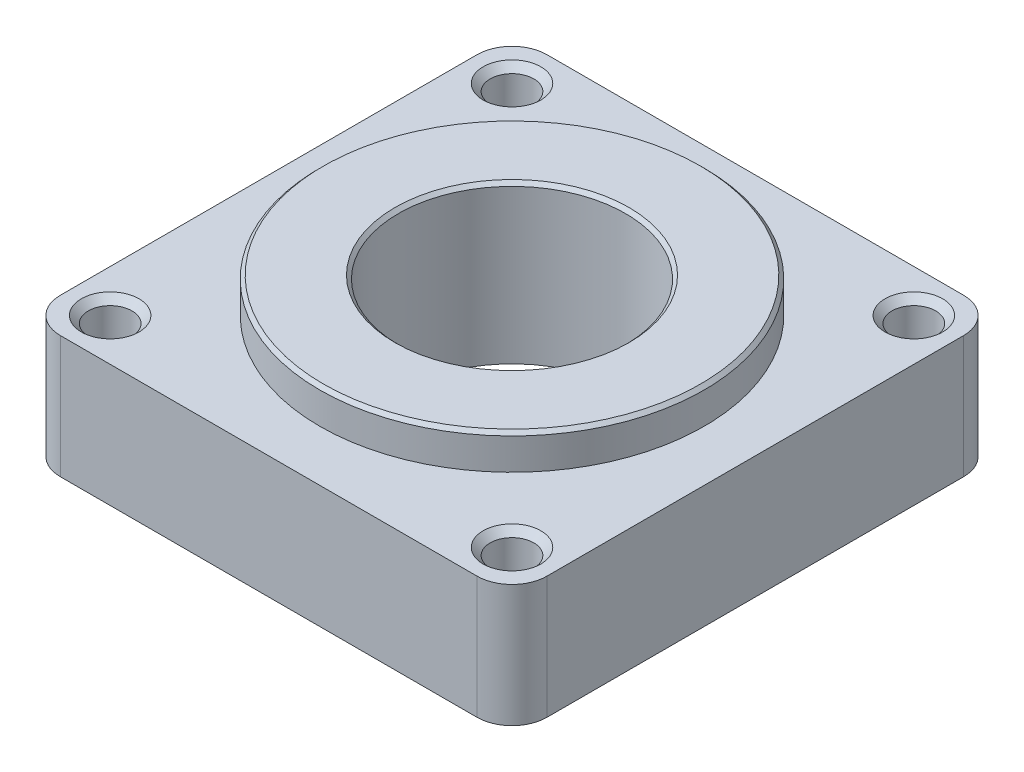
ISO-10303-21;
HEADER;
FILE_DESCRIPTION(('STEP AP214'),'2;1');
FILE_NAME('part.step','',(''),(''),'','','');
FILE_SCHEMA(('AUTOMOTIVE_DESIGN { 1 0 10303 214 1 1 1 1 }'));
ENDSEC;
DATA;
#1=APPLICATION_CONTEXT('core data for automotive mechanical design processes');
#2=APPLICATION_PROTOCOL_DEFINITION('international standard','automotive_design',2000,#1);
#3=PRODUCT_CONTEXT('',#1,'mechanical');
#4=PRODUCT('Part','Part','',(#3));
#5=PRODUCT_RELATED_PRODUCT_CATEGORY('part','',(#4));
#6=PRODUCT_DEFINITION_FORMATION('','',#4);
#7=PRODUCT_DEFINITION_CONTEXT('part definition',#1,'design');
#8=PRODUCT_DEFINITION('design','',#6,#7);
#9=PRODUCT_DEFINITION_SHAPE('','',#8);
#10=(LENGTH_UNIT() NAMED_UNIT(*) SI_UNIT(.MILLI.,.METRE.));
#11=(NAMED_UNIT(*) PLANE_ANGLE_UNIT() SI_UNIT($,.RADIAN.));
#12=(NAMED_UNIT(*) SI_UNIT($,.STERADIAN.) SOLID_ANGLE_UNIT());
#13=UNCERTAINTY_MEASURE_WITH_UNIT(LENGTH_MEASURE(1.E-05),#10,'distance_accuracy_value','');
#14=(GEOMETRIC_REPRESENTATION_CONTEXT(3) GLOBAL_UNCERTAINTY_ASSIGNED_CONTEXT((#13)) GLOBAL_UNIT_ASSIGNED_CONTEXT((#10,
#11,#12)) REPRESENTATION_CONTEXT('',''));
#15=CARTESIAN_POINT('',(0.,0.,0.));
#16=DIRECTION('',(0.,0.,1.));
#17=DIRECTION('',(1.,0.,0.));
#18=AXIS2_PLACEMENT_3D('',#15,#16,#17);
#19=CARTESIAN_POINT('',(0.,7.,0.));
#20=DIRECTION('',(0.,1.,0.));
#21=DIRECTION('',(0.,0.,1.));
#22=AXIS2_PLACEMENT_3D('',#19,#20,#21);
#23=PLANE('',#22);
#24=CARTESIAN_POINT('',(11.5,7.,-11.5));
#25=DIRECTION('',(0.,1.,0.));
#26=DIRECTION('',(0.,0.,1.));
#27=AXIS2_PLACEMENT_3D('',#24,#25,#26);
#28=CIRCLE('',#27,1.65);
#29=CARTESIAN_POINT('',(11.5,7.,-9.85));
#30=VERTEX_POINT('',#29);
#31=EDGE_CURVE('E205',#30,#30,#28,.F.);
#32=ORIENTED_EDGE('',*,*,#31,.T.);
#33=EDGE_LOOP('',(#32));
#34=FACE_BOUND('',#33,.T.);
#35=CARTESIAN_POINT('',(-11.5,7.,-11.5));
#36=DIRECTION('',(0.,1.,0.));
#37=DIRECTION('',(0.,0.,1.));
#38=AXIS2_PLACEMENT_3D('',#35,#36,#37);
#39=CIRCLE('',#38,1.65);
#40=CARTESIAN_POINT('',(-11.5,7.,-9.85));
#41=VERTEX_POINT('',#40);
#42=EDGE_CURVE('E202',#41,#41,#39,.F.);
#43=ORIENTED_EDGE('',*,*,#42,.T.);
#44=EDGE_LOOP('',(#43));
#45=FACE_BOUND('',#44,.T.);
#46=CARTESIAN_POINT('',(11.5,7.,11.5));
#47=DIRECTION('',(0.,1.,0.));
#48=DIRECTION('',(0.,0.,1.));
#49=AXIS2_PLACEMENT_3D('',#46,#47,#48);
#50=CIRCLE('',#49,1.65);
#51=CARTESIAN_POINT('',(11.5,7.,13.15));
#52=VERTEX_POINT('',#51);
#53=EDGE_CURVE('E199',#52,#52,#50,.F.);
#54=ORIENTED_EDGE('',*,*,#53,.T.);
#55=EDGE_LOOP('',(#54));
#56=FACE_BOUND('',#55,.T.);
#57=CARTESIAN_POINT('',(-11.5,7.,11.5));
#58=DIRECTION('',(0.,1.,0.));
#59=DIRECTION('',(0.,0.,1.));
#60=AXIS2_PLACEMENT_3D('',#57,#58,#59);
#61=CIRCLE('',#60,1.65);
#62=CARTESIAN_POINT('',(-11.5,7.,13.15));
#63=VERTEX_POINT('',#62);
#64=EDGE_CURVE('E196',#63,#63,#61,.F.);
#65=ORIENTED_EDGE('',*,*,#64,.T.);
#66=EDGE_LOOP('',(#65));
#67=FACE_BOUND('',#66,.T.);
#68=DIRECTION('',(0.,0.,1.));
#69=VECTOR('',#68,1.);
#70=CARTESIAN_POINT('',(-13.925,7.,0.));
#71=LINE('',#70,#69);
#72=CARTESIAN_POINT('',(-13.925,7.,-11.925));
#73=VERTEX_POINT('',#72);
#74=CARTESIAN_POINT('',(-13.925,7.,11.925));
#75=VERTEX_POINT('',#74);
#76=EDGE_CURVE('E164',#73,#75,#71,.T.);
#77=ORIENTED_EDGE('',*,*,#76,.T.);
#78=CARTESIAN_POINT('',(-11.925,7.,11.925));
#79=DIRECTION('',(0.,1.,0.));
#80=DIRECTION('',(0.,0.,1.));
#81=AXIS2_PLACEMENT_3D('',#78,#79,#80);
#82=CIRCLE('',#81,2.);
#83=CARTESIAN_POINT('',(-11.925,7.,13.925));
#84=VERTEX_POINT('',#83);
#85=EDGE_CURVE('E151',#75,#84,#82,.T.);
#86=ORIENTED_EDGE('',*,*,#85,.T.);
#87=DIRECTION('',(-1.,0.,0.));
#88=VECTOR('',#87,1.);
#89=CARTESIAN_POINT('',(0.,7.,13.925));
#90=LINE('',#89,#88);
#91=CARTESIAN_POINT('',(11.925,7.,13.925));
#92=VERTEX_POINT('',#91);
#93=EDGE_CURVE('E162',#92,#84,#90,.T.);
#94=ORIENTED_EDGE('',*,*,#93,.F.);
#95=CARTESIAN_POINT('',(11.925,7.,11.925));
#96=DIRECTION('',(0.,1.,0.));
#97=DIRECTION('',(0.,0.,1.));
#98=AXIS2_PLACEMENT_3D('',#95,#96,#97);
#99=CIRCLE('',#98,2.);
#100=CARTESIAN_POINT('',(13.925,7.,11.925));
#101=VERTEX_POINT('',#100);
#102=EDGE_CURVE('E128',#92,#101,#99,.T.);
#103=ORIENTED_EDGE('',*,*,#102,.T.);
#104=DIRECTION('',(0.,0.,1.));
#105=VECTOR('',#104,1.);
#106=CARTESIAN_POINT('',(13.925,7.,0.));
#107=LINE('',#106,#105);
#108=CARTESIAN_POINT('',(13.925,7.,-11.925));
#109=VERTEX_POINT('',#108);
#110=EDGE_CURVE('E160',#109,#101,#107,.T.);
#111=ORIENTED_EDGE('',*,*,#110,.F.);
#112=CARTESIAN_POINT('',(11.925,7.,-11.925));
#113=DIRECTION('',(0.,1.,0.));
#114=DIRECTION('',(0.,0.,1.));
#115=AXIS2_PLACEMENT_3D('',#112,#113,#114);
#116=CIRCLE('',#115,2.);
#117=CARTESIAN_POINT('',(11.925,7.,-13.925));
#118=VERTEX_POINT('',#117);
#119=EDGE_CURVE('E53',#109,#118,#116,.T.);
#120=ORIENTED_EDGE('',*,*,#119,.T.);
#121=DIRECTION('',(1.,0.,0.));
#122=VECTOR('',#121,1.);
#123=CARTESIAN_POINT('',(0.,7.,-13.925));
#124=LINE('',#123,#122);
#125=CARTESIAN_POINT('',(-11.925,7.,-13.925));
#126=VERTEX_POINT('',#125);
#127=EDGE_CURVE('E161',#126,#118,#124,.T.);
#128=ORIENTED_EDGE('',*,*,#127,.F.);
#129=CARTESIAN_POINT('',(-11.925,7.,-11.925));
#130=DIRECTION('',(0.,1.,0.));
#131=DIRECTION('',(0.,0.,1.));
#132=AXIS2_PLACEMENT_3D('',#129,#130,#131);
#133=CIRCLE('',#132,2.);
#134=EDGE_CURVE('E149',#126,#73,#133,.T.);
#135=ORIENTED_EDGE('',*,*,#134,.T.);
#136=EDGE_LOOP('',(#77,#86,#94,#103,#111,#120,#128,#135));
#137=FACE_BOUND('',#136,.T.);
#138=CARTESIAN_POINT('',(0.,7.,0.));
#139=DIRECTION('',(0.,1.,0.));
#140=DIRECTION('',(0.,0.,1.));
#141=AXIS2_PLACEMENT_3D('',#138,#139,#140);
#142=CIRCLE('',#141,11.);
#143=CARTESIAN_POINT('',(0.,7.,11.));
#144=VERTEX_POINT('',#143);
#145=EDGE_CURVE('E177',#144,#144,#142,.F.);
#146=ORIENTED_EDGE('',*,*,#145,.T.);
#147=EDGE_LOOP('',(#146));
#148=FACE_BOUND('',#147,.T.);
#149=ADVANCED_FACE('F38',(#34,#45,#56,#67,#137,#148),#23,.T.);
#150=CARTESIAN_POINT('',(0.,7.,13.925));
#151=DIRECTION('',(0.,0.,1.));
#152=DIRECTION('',(1.,0.,0.));
#153=AXIS2_PLACEMENT_3D('',#150,#151,#152);
#154=PLANE('',#153);
#155=ORIENTED_EDGE('',*,*,#93,.T.);
#156=DIRECTION('',(0.,-1.,0.));
#157=VECTOR('',#156,1.);
#158=CARTESIAN_POINT('',(-11.925,0.,13.925));
#159=LINE('',#158,#157);
#160=CARTESIAN_POINT('',(-11.925,0.,13.925));
#161=VERTEX_POINT('',#160);
#162=EDGE_CURVE('E116',#84,#161,#159,.T.);
#163=ORIENTED_EDGE('',*,*,#162,.T.);
#164=DIRECTION('',(-1.,0.,0.));
#165=VECTOR('',#164,1.);
#166=CARTESIAN_POINT('',(0.,0.,13.925));
#167=LINE('',#166,#165);
#168=CARTESIAN_POINT('',(11.925,0.,13.925));
#169=VERTEX_POINT('',#168);
#170=EDGE_CURVE('E108',#169,#161,#167,.T.);
#171=ORIENTED_EDGE('',*,*,#170,.F.);
#172=DIRECTION('',(0.,-1.,0.));
#173=VECTOR('',#172,1.);
#174=CARTESIAN_POINT('',(11.925,7.,13.925));
#175=LINE('',#174,#173);
#176=EDGE_CURVE('E122',#169,#92,#175,.F.);
#177=ORIENTED_EDGE('',*,*,#176,.T.);
#178=EDGE_LOOP('',(#155,#163,#171,#177));
#179=FACE_BOUND('',#178,.T.);
#180=ADVANCED_FACE('F121',(#179),#154,.T.);
#181=CARTESIAN_POINT('',(13.925,7.,0.));
#182=DIRECTION('',(1.,0.,0.));
#183=DIRECTION('',(0.,0.,-1.));
#184=AXIS2_PLACEMENT_3D('',#181,#182,#183);
#185=PLANE('',#184);
#186=DIRECTION('',(0.,0.,1.));
#187=VECTOR('',#186,1.);
#188=CARTESIAN_POINT('',(13.925,0.,0.));
#189=LINE('',#188,#187);
#190=CARTESIAN_POINT('',(13.925,0.,-11.925));
#191=VERTEX_POINT('',#190);
#192=CARTESIAN_POINT('',(13.925,0.,11.925));
#193=VERTEX_POINT('',#192);
#194=EDGE_CURVE('E110',#191,#193,#189,.T.);
#195=ORIENTED_EDGE('',*,*,#194,.F.);
#196=DIRECTION('',(0.,-1.,0.));
#197=VECTOR('',#196,1.);
#198=CARTESIAN_POINT('',(13.925,7.,-11.925));
#199=LINE('',#198,#197);
#200=EDGE_CURVE('E11',#191,#109,#199,.F.);
#201=ORIENTED_EDGE('',*,*,#200,.T.);
#202=ORIENTED_EDGE('',*,*,#110,.T.);
#203=DIRECTION('',(0.,-1.,0.));
#204=VECTOR('',#203,1.);
#205=CARTESIAN_POINT('',(13.925,7.,11.925));
#206=LINE('',#205,#204);
#207=EDGE_CURVE('E46',#101,#193,#206,.T.);
#208=ORIENTED_EDGE('',*,*,#207,.T.);
#209=EDGE_LOOP('',(#195,#201,#202,#208));
#210=FACE_BOUND('',#209,.T.);
#211=ADVANCED_FACE('F158',(#210),#185,.T.);
#212=CARTESIAN_POINT('',(0.,7.,-13.925));
#213=DIRECTION('',(0.,0.,-1.));
#214=DIRECTION('',(-1.,0.,0.));
#215=AXIS2_PLACEMENT_3D('',#212,#213,#214);
#216=PLANE('',#215);
#217=DIRECTION('',(1.,0.,0.));
#218=VECTOR('',#217,1.);
#219=CARTESIAN_POINT('',(0.,0.,-13.925));
#220=LINE('',#219,#218);
#221=CARTESIAN_POINT('',(-11.925,0.,-13.925));
#222=VERTEX_POINT('',#221);
#223=CARTESIAN_POINT('',(11.925,0.,-13.925));
#224=VERTEX_POINT('',#223);
#225=EDGE_CURVE('E186',#222,#224,#220,.T.);
#226=ORIENTED_EDGE('',*,*,#225,.F.);
#227=DIRECTION('',(0.,-1.,0.));
#228=VECTOR('',#227,1.);
#229=CARTESIAN_POINT('',(-11.925,7.,-13.925));
#230=LINE('',#229,#228);
#231=EDGE_CURVE('E60',#222,#126,#230,.F.);
#232=ORIENTED_EDGE('',*,*,#231,.T.);
#233=ORIENTED_EDGE('',*,*,#127,.T.);
#234=DIRECTION('',(0.,-1.,0.));
#235=VECTOR('',#234,1.);
#236=CARTESIAN_POINT('',(11.925,7.,-13.925));
#237=LINE('',#236,#235);
#238=EDGE_CURVE('E153',#118,#224,#237,.T.);
#239=ORIENTED_EDGE('',*,*,#238,.T.);
#240=EDGE_LOOP('',(#226,#232,#233,#239));
#241=FACE_BOUND('',#240,.T.);
#242=ADVANCED_FACE('F302',(#241),#216,.T.);
#243=CARTESIAN_POINT('',(-13.925,7.,0.));
#244=DIRECTION('',(1.,0.,0.));
#245=DIRECTION('',(0.,0.,-1.));
#246=AXIS2_PLACEMENT_3D('',#243,#244,#245);
#247=PLANE('',#246);
#248=DIRECTION('',(0.,0.,1.));
#249=VECTOR('',#248,1.);
#250=CARTESIAN_POINT('',(-13.925,0.,0.));
#251=LINE('',#250,#249);
#252=CARTESIAN_POINT('',(-13.925,0.,-11.925));
#253=VERTEX_POINT('',#252);
#254=CARTESIAN_POINT('',(-13.925,0.,11.925));
#255=VERTEX_POINT('',#254);
#256=EDGE_CURVE('E189',#253,#255,#251,.T.);
#257=ORIENTED_EDGE('',*,*,#256,.T.);
#258=DIRECTION('',(0.,-1.,0.));
#259=VECTOR('',#258,1.);
#260=CARTESIAN_POINT('',(-13.925,7.,11.925));
#261=LINE('',#260,#259);
#262=EDGE_CURVE('E145',#255,#75,#261,.F.);
#263=ORIENTED_EDGE('',*,*,#262,.T.);
#264=ORIENTED_EDGE('',*,*,#76,.F.);
#265=DIRECTION('',(0.,-1.,0.));
#266=VECTOR('',#265,1.);
#267=CARTESIAN_POINT('',(-13.925,0.,-11.925));
#268=LINE('',#267,#266);
#269=EDGE_CURVE('E142',#73,#253,#268,.T.);
#270=ORIENTED_EDGE('',*,*,#269,.T.);
#271=EDGE_LOOP('',(#257,#263,#264,#270));
#272=FACE_BOUND('',#271,.T.);
#273=ADVANCED_FACE('F308',(#272),#247,.F.);
#274=CARTESIAN_POINT('',(-11.5,7.,-11.5));
#275=DIRECTION('',(0.,-1.,0.));
#276=DIRECTION('',(0.,0.,-1.));
#277=AXIS2_PLACEMENT_3D('',#274,#275,#276);
#278=CYLINDRICAL_SURFACE('',#277,1.25);
#279=CARTESIAN_POINT('',(-11.5,6.6,-11.5));
#280=DIRECTION('',(0.,1.,0.));
#281=DIRECTION('',(0.,0.,1.));
#282=AXIS2_PLACEMENT_3D('',#279,#280,#281);
#283=CIRCLE('',#282,1.25);
#284=CARTESIAN_POINT('',(-11.5,6.6,-10.25));
#285=VERTEX_POINT('',#284);
#286=EDGE_CURVE('E208',#285,#285,#283,.T.);
#287=ORIENTED_EDGE('',*,*,#286,.T.);
#288=EDGE_LOOP('',(#287));
#289=FACE_BOUND('',#288,.T.);
#290=CARTESIAN_POINT('',(-11.5,0.,-11.5));
#291=DIRECTION('',(0.,1.,0.));
#292=DIRECTION('',(0.,0.,1.));
#293=AXIS2_PLACEMENT_3D('',#290,#291,#292);
#294=CIRCLE('',#293,1.25);
#295=CARTESIAN_POINT('',(-11.5,0.,-10.25));
#296=VERTEX_POINT('',#295);
#297=EDGE_CURVE('E125',#296,#296,#294,.T.);
#298=ORIENTED_EDGE('',*,*,#297,.F.);
#299=EDGE_LOOP('',(#298));
#300=FACE_BOUND('',#299,.T.);
#301=ADVANCED_FACE('F316',(#289,#300),#278,.F.);
#302=CARTESIAN_POINT('',(11.5,7.,-11.5));
#303=DIRECTION('',(0.,-1.,0.));
#304=DIRECTION('',(0.,0.,-1.));
#305=AXIS2_PLACEMENT_3D('',#302,#303,#304);
#306=CYLINDRICAL_SURFACE('',#305,1.25);
#307=CARTESIAN_POINT('',(11.5,6.6,-11.5));
#308=DIRECTION('',(0.,1.,0.));
#309=DIRECTION('',(0.,0.,1.));
#310=AXIS2_PLACEMENT_3D('',#307,#308,#309);
#311=CIRCLE('',#310,1.25);
#312=CARTESIAN_POINT('',(11.5,6.6,-10.25));
#313=VERTEX_POINT('',#312);
#314=EDGE_CURVE('E172',#313,#313,#311,.T.);
#315=ORIENTED_EDGE('',*,*,#314,.T.);
#316=EDGE_LOOP('',(#315));
#317=FACE_BOUND('',#316,.T.);
#318=CARTESIAN_POINT('',(11.5,0.,-11.5));
#319=DIRECTION('',(0.,1.,0.));
#320=DIRECTION('',(0.,0.,1.));
#321=AXIS2_PLACEMENT_3D('',#318,#319,#320);
#322=CIRCLE('',#321,1.25);
#323=CARTESIAN_POINT('',(11.5,0.,-10.25));
#324=VERTEX_POINT('',#323);
#325=EDGE_CURVE('E180',#324,#324,#322,.T.);
#326=ORIENTED_EDGE('',*,*,#325,.F.);
#327=EDGE_LOOP('',(#326));
#328=FACE_BOUND('',#327,.T.);
#329=ADVANCED_FACE('F322',(#317,#328),#306,.F.);
#330=CARTESIAN_POINT('',(-11.5,7.,11.5));
#331=DIRECTION('',(0.,-1.,0.));
#332=DIRECTION('',(0.,0.,-1.));
#333=AXIS2_PLACEMENT_3D('',#330,#331,#332);
#334=CYLINDRICAL_SURFACE('',#333,1.25);
#335=CARTESIAN_POINT('',(-11.5,6.6,11.5));
#336=DIRECTION('',(0.,1.,0.));
#337=DIRECTION('',(0.,0.,1.));
#338=AXIS2_PLACEMENT_3D('',#335,#336,#337);
#339=CIRCLE('',#338,1.25);
#340=CARTESIAN_POINT('',(-11.5,6.6,12.75));
#341=VERTEX_POINT('',#340);
#342=EDGE_CURVE('E214',#341,#341,#339,.T.);
#343=ORIENTED_EDGE('',*,*,#342,.T.);
#344=EDGE_LOOP('',(#343));
#345=FACE_BOUND('',#344,.T.);
#346=CARTESIAN_POINT('',(-11.5,0.,11.5));
#347=DIRECTION('',(0.,1.,0.));
#348=DIRECTION('',(0.,0.,1.));
#349=AXIS2_PLACEMENT_3D('',#346,#347,#348);
#350=CIRCLE('',#349,1.25);
#351=CARTESIAN_POINT('',(-11.5,0.,12.75));
#352=VERTEX_POINT('',#351);
#353=EDGE_CURVE('E176',#352,#352,#350,.T.);
#354=ORIENTED_EDGE('',*,*,#353,.F.);
#355=EDGE_LOOP('',(#354));
#356=FACE_BOUND('',#355,.T.);
#357=ADVANCED_FACE('F330',(#345,#356),#334,.F.);
#358=CARTESIAN_POINT('',(11.5,7.,11.5));
#359=DIRECTION('',(0.,-1.,0.));
#360=DIRECTION('',(0.,0.,-1.));
#361=AXIS2_PLACEMENT_3D('',#358,#359,#360);
#362=CYLINDRICAL_SURFACE('',#361,1.25);
#363=CARTESIAN_POINT('',(11.5,6.6,11.5));
#364=DIRECTION('',(0.,1.,0.));
#365=DIRECTION('',(0.,0.,1.));
#366=AXIS2_PLACEMENT_3D('',#363,#364,#365);
#367=CIRCLE('',#366,1.25);
#368=CARTESIAN_POINT('',(11.5,6.6,12.75));
#369=VERTEX_POINT('',#368);
#370=EDGE_CURVE('E211',#369,#369,#367,.T.);
#371=ORIENTED_EDGE('',*,*,#370,.T.);
#372=EDGE_LOOP('',(#371));
#373=FACE_BOUND('',#372,.T.);
#374=CARTESIAN_POINT('',(11.5,0.,11.5));
#375=DIRECTION('',(0.,1.,0.));
#376=DIRECTION('',(0.,0.,1.));
#377=AXIS2_PLACEMENT_3D('',#374,#375,#376);
#378=CIRCLE('',#377,1.25);
#379=CARTESIAN_POINT('',(11.5,0.,12.75));
#380=VERTEX_POINT('',#379);
#381=EDGE_CURVE('E173',#380,#380,#378,.T.);
#382=ORIENTED_EDGE('',*,*,#381,.F.);
#383=EDGE_LOOP('',(#382));
#384=FACE_BOUND('',#383,.T.);
#385=ADVANCED_FACE('F239',(#373,#384),#362,.F.);
#386=CARTESIAN_POINT('',(0.,7.,0.));
#387=DIRECTION('',(0.,-1.,0.));
#388=DIRECTION('',(0.,0.,-1.));
#389=AXIS2_PLACEMENT_3D('',#386,#387,#388);
#390=CYLINDRICAL_SURFACE('',#389,6.5);
#391=CARTESIAN_POINT('',(0.,8.79999999999999,0.));
#392=DIRECTION('',(0.,1.,0.));
#393=DIRECTION('',(0.,0.,1.));
#394=AXIS2_PLACEMENT_3D('',#391,#392,#393);
#395=CIRCLE('',#394,6.5);
#396=CARTESIAN_POINT('',(0.,8.79999999999999,6.5));
#397=VERTEX_POINT('',#396);
#398=EDGE_CURVE('E217',#397,#397,#395,.T.);
#399=ORIENTED_EDGE('',*,*,#398,.T.);
#400=EDGE_LOOP('',(#399));
#401=FACE_BOUND('',#400,.T.);
#402=CARTESIAN_POINT('',(0.,0.,0.));
#403=DIRECTION('',(0.,1.,0.));
#404=DIRECTION('',(0.,0.,1.));
#405=AXIS2_PLACEMENT_3D('',#402,#403,#404);
#406=CIRCLE('',#405,6.5);
#407=CARTESIAN_POINT('',(0.,0.,6.5));
#408=VERTEX_POINT('',#407);
#409=EDGE_CURVE('E166',#408,#408,#406,.T.);
#410=ORIENTED_EDGE('',*,*,#409,.F.);
#411=EDGE_LOOP('',(#410));
#412=FACE_BOUND('',#411,.T.);
#413=ADVANCED_FACE('F236',(#401,#412),#390,.F.);
#414=CARTESIAN_POINT('',(0.,0.,0.));
#415=DIRECTION('',(0.,1.,0.));
#416=DIRECTION('',(0.,0.,1.));
#417=AXIS2_PLACEMENT_3D('',#414,#415,#416);
#418=PLANE('',#417);
#419=ORIENTED_EDGE('',*,*,#409,.T.);
#420=EDGE_LOOP('',(#419));
#421=FACE_BOUND('',#420,.T.);
#422=ORIENTED_EDGE('',*,*,#170,.T.);
#423=CARTESIAN_POINT('',(-11.925,0.,11.925));
#424=DIRECTION('',(0.,1.,0.));
#425=DIRECTION('',(0.,0.,1.));
#426=AXIS2_PLACEMENT_3D('',#423,#424,#425);
#427=CIRCLE('',#426,2.);
#428=EDGE_CURVE('E140',#161,#255,#427,.F.);
#429=ORIENTED_EDGE('',*,*,#428,.T.);
#430=ORIENTED_EDGE('',*,*,#256,.F.);
#431=CARTESIAN_POINT('',(-11.925,0.,-11.925));
#432=DIRECTION('',(0.,1.,0.));
#433=DIRECTION('',(0.,0.,1.));
#434=AXIS2_PLACEMENT_3D('',#431,#432,#433);
#435=CIRCLE('',#434,2.);
#436=EDGE_CURVE('E138',#253,#222,#435,.F.);
#437=ORIENTED_EDGE('',*,*,#436,.T.);
#438=ORIENTED_EDGE('',*,*,#225,.T.);
#439=CARTESIAN_POINT('',(11.925,0.,-11.925));
#440=DIRECTION('',(0.,1.,0.));
#441=DIRECTION('',(0.,0.,1.));
#442=AXIS2_PLACEMENT_3D('',#439,#440,#441);
#443=CIRCLE('',#442,2.);
#444=EDGE_CURVE('E115',#224,#191,#443,.F.);
#445=ORIENTED_EDGE('',*,*,#444,.T.);
#446=ORIENTED_EDGE('',*,*,#194,.T.);
#447=CARTESIAN_POINT('',(11.925,0.,11.925));
#448=DIRECTION('',(0.,1.,0.));
#449=DIRECTION('',(0.,0.,1.));
#450=AXIS2_PLACEMENT_3D('',#447,#448,#449);
#451=CIRCLE('',#450,2.);
#452=EDGE_CURVE('E104',#193,#169,#451,.F.);
#453=ORIENTED_EDGE('',*,*,#452,.T.);
#454=EDGE_LOOP('',(#422,#429,#430,#437,#438,#445,#446,#453));
#455=FACE_BOUND('',#454,.T.);
#456=ORIENTED_EDGE('',*,*,#297,.T.);
#457=EDGE_LOOP('',(#456));
#458=FACE_BOUND('',#457,.T.);
#459=ORIENTED_EDGE('',*,*,#325,.T.);
#460=EDGE_LOOP('',(#459));
#461=FACE_BOUND('',#460,.T.);
#462=ORIENTED_EDGE('',*,*,#353,.T.);
#463=EDGE_LOOP('',(#462));
#464=FACE_BOUND('',#463,.T.);
#465=ORIENTED_EDGE('',*,*,#381,.T.);
#466=EDGE_LOOP('',(#465));
#467=FACE_BOUND('',#466,.T.);
#468=ADVANCED_FACE('F106',(#421,#455,#458,#461,#464,#467),#418,.F.);
#469=CARTESIAN_POINT('',(0.,9.,0.));
#470=DIRECTION('',(0.,-1.,0.));
#471=DIRECTION('',(0.,0.,-1.));
#472=AXIS2_PLACEMENT_3D('',#469,#470,#471);
#473=CYLINDRICAL_SURFACE('',#472,11.);
#474=CARTESIAN_POINT('',(0.,8.8,0.));
#475=DIRECTION('',(0.,1.,0.));
#476=DIRECTION('',(0.,0.,1.));
#477=AXIS2_PLACEMENT_3D('',#474,#475,#476);
#478=CIRCLE('',#477,11.);
#479=CARTESIAN_POINT('',(0.,8.8,11.));
#480=VERTEX_POINT('',#479);
#481=EDGE_CURVE('E129',#480,#480,#478,.F.);
#482=ORIENTED_EDGE('',*,*,#481,.T.);
#483=EDGE_LOOP('',(#482));
#484=FACE_BOUND('',#483,.T.);
#485=ORIENTED_EDGE('',*,*,#145,.F.);
#486=EDGE_LOOP('',(#485));
#487=FACE_BOUND('',#486,.T.);
#488=ADVANCED_FACE('F244',(#484,#487),#473,.T.);
#489=CARTESIAN_POINT('',(0.,9.,0.));
#490=DIRECTION('',(0.,1.,0.));
#491=DIRECTION('',(0.,0.,1.));
#492=AXIS2_PLACEMENT_3D('',#489,#490,#491);
#493=PLANE('',#492);
#494=CARTESIAN_POINT('',(0.,9.,0.));
#495=DIRECTION('',(0.,1.,0.));
#496=DIRECTION('',(0.,0.,1.));
#497=AXIS2_PLACEMENT_3D('',#494,#495,#496);
#498=CIRCLE('',#497,6.7);
#499=CARTESIAN_POINT('',(0.,9.,6.7));
#500=VERTEX_POINT('',#499);
#501=EDGE_CURVE('E133',#500,#500,#498,.F.);
#502=ORIENTED_EDGE('',*,*,#501,.T.);
#503=EDGE_LOOP('',(#502));
#504=FACE_BOUND('',#503,.T.);
#505=CARTESIAN_POINT('',(0.,9.,0.));
#506=DIRECTION('',(0.,1.,0.));
#507=DIRECTION('',(0.,0.,1.));
#508=AXIS2_PLACEMENT_3D('',#505,#506,#507);
#509=CIRCLE('',#508,10.8);
#510=CARTESIAN_POINT('',(0.,9.,10.8));
#511=VERTEX_POINT('',#510);
#512=EDGE_CURVE('E220',#511,#511,#509,.T.);
#513=ORIENTED_EDGE('',*,*,#512,.T.);
#514=EDGE_LOOP('',(#513));
#515=FACE_BOUND('',#514,.T.);
#516=ADVANCED_FACE('F225',(#504,#515),#493,.T.);
#517=CARTESIAN_POINT('',(11.5,6.6,-11.5));
#518=DIRECTION('',(0.,1.,0.));
#519=DIRECTION('',(0.,0.,1.));
#520=AXIS2_PLACEMENT_3D('',#517,#518,#519);
#521=CONICAL_SURFACE('',#520,1.25,0.785398163397453);
#522=ORIENTED_EDGE('',*,*,#31,.F.);
#523=EDGE_LOOP('',(#522));
#524=FACE_BOUND('',#523,.T.);
#525=ORIENTED_EDGE('',*,*,#314,.F.);
#526=EDGE_LOOP('',(#525));
#527=FACE_BOUND('',#526,.T.);
#528=ADVANCED_FACE('F261',(#524,#527),#521,.F.);
#529=CARTESIAN_POINT('',(-11.5,6.6,-11.5));
#530=DIRECTION('',(0.,1.,0.));
#531=DIRECTION('',(0.,0.,1.));
#532=AXIS2_PLACEMENT_3D('',#529,#530,#531);
#533=CONICAL_SURFACE('',#532,1.25,0.785398163397453);
#534=ORIENTED_EDGE('',*,*,#42,.F.);
#535=EDGE_LOOP('',(#534));
#536=FACE_BOUND('',#535,.T.);
#537=ORIENTED_EDGE('',*,*,#286,.F.);
#538=EDGE_LOOP('',(#537));
#539=FACE_BOUND('',#538,.T.);
#540=ADVANCED_FACE('F265',(#536,#539),#533,.F.);
#541=CARTESIAN_POINT('',(11.5,6.6,11.5));
#542=DIRECTION('',(0.,1.,0.));
#543=DIRECTION('',(0.,0.,1.));
#544=AXIS2_PLACEMENT_3D('',#541,#542,#543);
#545=CONICAL_SURFACE('',#544,1.25,0.785398163397453);
#546=ORIENTED_EDGE('',*,*,#53,.F.);
#547=EDGE_LOOP('',(#546));
#548=FACE_BOUND('',#547,.T.);
#549=ORIENTED_EDGE('',*,*,#370,.F.);
#550=EDGE_LOOP('',(#549));
#551=FACE_BOUND('',#550,.T.);
#552=ADVANCED_FACE('F271',(#548,#551),#545,.F.);
#553=CARTESIAN_POINT('',(-11.5,6.6,11.5));
#554=DIRECTION('',(0.,1.,0.));
#555=DIRECTION('',(0.,0.,1.));
#556=AXIS2_PLACEMENT_3D('',#553,#554,#555);
#557=CONICAL_SURFACE('',#556,1.25,0.785398163397453);
#558=ORIENTED_EDGE('',*,*,#64,.F.);
#559=EDGE_LOOP('',(#558));
#560=FACE_BOUND('',#559,.T.);
#561=ORIENTED_EDGE('',*,*,#342,.F.);
#562=EDGE_LOOP('',(#561));
#563=FACE_BOUND('',#562,.T.);
#564=ADVANCED_FACE('F232',(#560,#563),#557,.F.);
#565=CARTESIAN_POINT('',(0.,8.79999999999999,0.));
#566=DIRECTION('',(0.,1.,0.));
#567=DIRECTION('',(0.,0.,1.));
#568=AXIS2_PLACEMENT_3D('',#565,#566,#567);
#569=CONICAL_SURFACE('',#568,6.5,0.785398163397435);
#570=ORIENTED_EDGE('',*,*,#501,.F.);
#571=EDGE_LOOP('',(#570));
#572=FACE_BOUND('',#571,.T.);
#573=ORIENTED_EDGE('',*,*,#398,.F.);
#574=EDGE_LOOP('',(#573));
#575=FACE_BOUND('',#574,.T.);
#576=ADVANCED_FACE('F228',(#572,#575),#569,.F.);
#577=CARTESIAN_POINT('',(0.,9.,0.));
#578=DIRECTION('',(0.,-1.,0.));
#579=DIRECTION('',(0.,0.,-1.));
#580=AXIS2_PLACEMENT_3D('',#577,#578,#579);
#581=CONICAL_SURFACE('',#580,10.8,0.785398163397448);
#582=ORIENTED_EDGE('',*,*,#481,.F.);
#583=EDGE_LOOP('',(#582));
#584=FACE_BOUND('',#583,.T.);
#585=ORIENTED_EDGE('',*,*,#512,.F.);
#586=EDGE_LOOP('',(#585));
#587=FACE_BOUND('',#586,.T.);
#588=ADVANCED_FACE('F231',(#584,#587),#581,.T.);
#589=CARTESIAN_POINT('',(-11.925,7.,11.925));
#590=DIRECTION('',(0.,1.,0.));
#591=DIRECTION('',(0.,0.,1.));
#592=AXIS2_PLACEMENT_3D('',#589,#590,#591);
#593=CYLINDRICAL_SURFACE('',#592,2.);
#594=ORIENTED_EDGE('',*,*,#85,.F.);
#595=ORIENTED_EDGE('',*,*,#262,.F.);
#596=ORIENTED_EDGE('',*,*,#428,.F.);
#597=ORIENTED_EDGE('',*,*,#162,.F.);
#598=EDGE_LOOP('',(#594,#595,#596,#597));
#599=FACE_BOUND('',#598,.T.);
#600=ADVANCED_FACE('F287',(#599),#593,.T.);
#601=CARTESIAN_POINT('',(-11.925,7.,-11.925));
#602=DIRECTION('',(0.,1.,0.));
#603=DIRECTION('',(0.,0.,1.));
#604=AXIS2_PLACEMENT_3D('',#601,#602,#603);
#605=CYLINDRICAL_SURFACE('',#604,2.);
#606=ORIENTED_EDGE('',*,*,#134,.F.);
#607=ORIENTED_EDGE('',*,*,#231,.F.);
#608=ORIENTED_EDGE('',*,*,#436,.F.);
#609=ORIENTED_EDGE('',*,*,#269,.F.);
#610=EDGE_LOOP('',(#606,#607,#608,#609));
#611=FACE_BOUND('',#610,.T.);
#612=ADVANCED_FACE('F291',(#611),#605,.T.);
#613=CARTESIAN_POINT('',(11.925,7.,-11.925));
#614=DIRECTION('',(0.,-1.,0.));
#615=DIRECTION('',(0.,0.,-1.));
#616=AXIS2_PLACEMENT_3D('',#613,#614,#615);
#617=CYLINDRICAL_SURFACE('',#616,2.);
#618=ORIENTED_EDGE('',*,*,#119,.F.);
#619=ORIENTED_EDGE('',*,*,#200,.F.);
#620=ORIENTED_EDGE('',*,*,#444,.F.);
#621=ORIENTED_EDGE('',*,*,#238,.F.);
#622=EDGE_LOOP('',(#618,#619,#620,#621));
#623=FACE_BOUND('',#622,.T.);
#624=ADVANCED_FACE('F294',(#623),#617,.T.);
#625=CARTESIAN_POINT('',(11.925,7.,11.925));
#626=DIRECTION('',(0.,-1.,0.));
#627=DIRECTION('',(0.,0.,-1.));
#628=AXIS2_PLACEMENT_3D('',#625,#626,#627);
#629=CYLINDRICAL_SURFACE('',#628,2.);
#630=ORIENTED_EDGE('',*,*,#102,.F.);
#631=ORIENTED_EDGE('',*,*,#176,.F.);
#632=ORIENTED_EDGE('',*,*,#452,.F.);
#633=ORIENTED_EDGE('',*,*,#207,.F.);
#634=EDGE_LOOP('',(#630,#631,#632,#633));
#635=FACE_BOUND('',#634,.T.);
#636=ADVANCED_FACE('F40',(#635),#629,.T.);
#637=CLOSED_SHELL('',(#149,#180,#211,#242,#273,#301,#329,#357,#385,#413,#468,#488,#516,#528,
#540,#552,#564,#576,#588,#600,#612,#624,#636));
#638=MANIFOLD_SOLID_BREP('B2',#637);
#639=ADVANCED_BREP_SHAPE_REPRESENTATION('',(#18,#638),#14);
#640=SHAPE_DEFINITION_REPRESENTATION(#9,#639);
ENDSEC;
END-ISO-10303-21;
